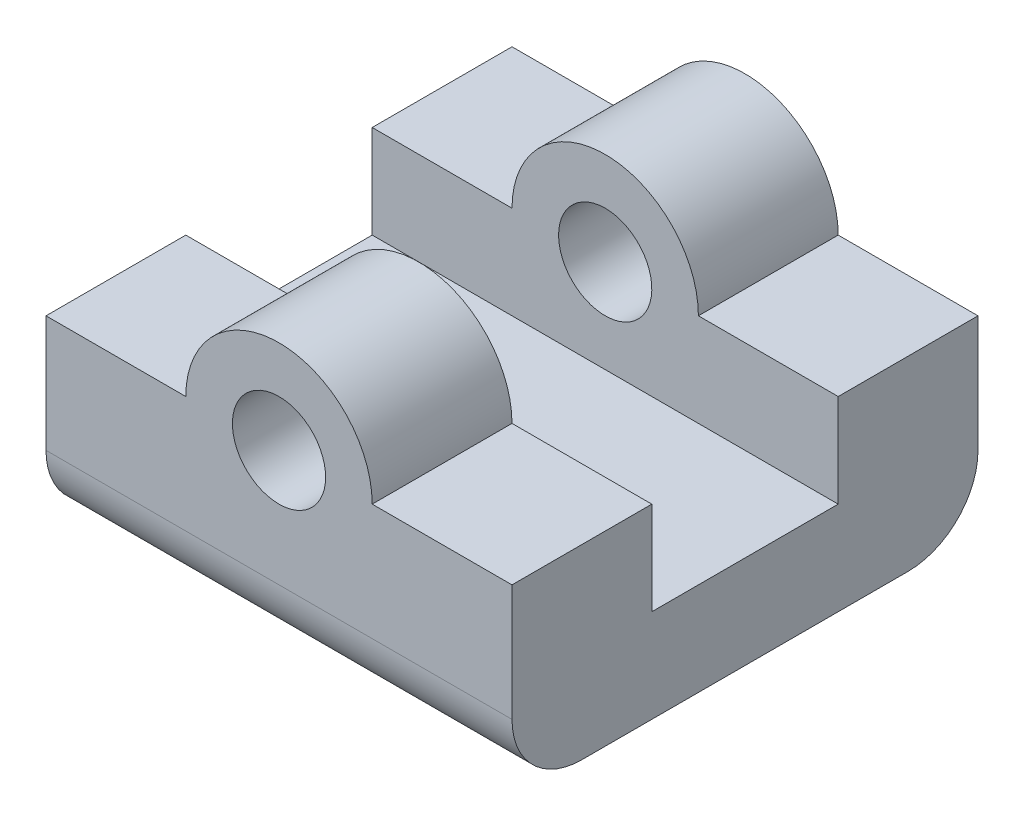
ISO-10303-21;
HEADER;
FILE_DESCRIPTION(('STEP AP214'),'2;1');
FILE_NAME('part.step','',(''),(''),'','','');
FILE_SCHEMA(('AUTOMOTIVE_DESIGN { 1 0 10303 214 1 1 1 1 }'));
ENDSEC;
DATA;
#1=APPLICATION_CONTEXT('core data for automotive mechanical design processes');
#2=APPLICATION_PROTOCOL_DEFINITION('international standard','automotive_design',2000,#1);
#3=PRODUCT_CONTEXT('',#1,'mechanical');
#4=PRODUCT('Part','Part','',(#3));
#5=PRODUCT_RELATED_PRODUCT_CATEGORY('part','',(#4));
#6=PRODUCT_DEFINITION_FORMATION('','',#4);
#7=PRODUCT_DEFINITION_CONTEXT('part definition',#1,'design');
#8=PRODUCT_DEFINITION('design','',#6,#7);
#9=PRODUCT_DEFINITION_SHAPE('','',#8);
#10=(LENGTH_UNIT() NAMED_UNIT(*) SI_UNIT(.MILLI.,.METRE.));
#11=(NAMED_UNIT(*) PLANE_ANGLE_UNIT() SI_UNIT($,.RADIAN.));
#12=(NAMED_UNIT(*) SI_UNIT($,.STERADIAN.) SOLID_ANGLE_UNIT());
#13=UNCERTAINTY_MEASURE_WITH_UNIT(LENGTH_MEASURE(1.E-05),#10,'distance_accuracy_value','');
#14=(GEOMETRIC_REPRESENTATION_CONTEXT(3) GLOBAL_UNCERTAINTY_ASSIGNED_CONTEXT((#13)) GLOBAL_UNIT_ASSIGNED_CONTEXT((#10,
#11,#12)) REPRESENTATION_CONTEXT('',''));
#15=CARTESIAN_POINT('',(0.,0.,0.));
#16=DIRECTION('',(0.,0.,1.));
#17=DIRECTION('',(1.,0.,0.));
#18=AXIS2_PLACEMENT_3D('',#15,#16,#17);
#19=CARTESIAN_POINT('',(-50.4804763273524,-10.,10.));
#20=DIRECTION('',(0.,-1.,0.));
#21=DIRECTION('',(0.,0.,-1.));
#22=AXIS2_PLACEMENT_3D('',#19,#20,#21);
#23=PLANE('',#22);
#24=DIRECTION('',(0.,0.,-1.));
#25=VECTOR('',#24,1.);
#26=CARTESIAN_POINT('',(-50.4804763273524,-10.,10.));
#27=LINE('',#26,#25);
#28=CARTESIAN_POINT('',(-50.4804763273524,-10.,10.));
#29=VERTEX_POINT('',#28);
#30=CARTESIAN_POINT('',(-50.4804763273524,-10.,4.));
#31=VERTEX_POINT('',#30);
#32=EDGE_CURVE('E228',#29,#31,#27,.T.);
#33=ORIENTED_EDGE('',*,*,#32,.T.);
#34=DIRECTION('',(-1.,0.,0.));
#35=VECTOR('',#34,1.);
#36=CARTESIAN_POINT('',(-50.4804763273524,-10.,4.));
#37=LINE('',#36,#35);
#38=CARTESIAN_POINT('',(-56.4804763273524,-10.,4.));
#39=VERTEX_POINT('',#38);
#40=EDGE_CURVE('E189',#31,#39,#37,.T.);
#41=ORIENTED_EDGE('',*,*,#40,.T.);
#42=DIRECTION('',(0.,0.,-1.));
#43=VECTOR('',#42,1.);
#44=CARTESIAN_POINT('',(-56.4804763273524,-10.,10.));
#45=LINE('',#44,#43);
#46=CARTESIAN_POINT('',(-56.4804763273524,-10.,10.));
#47=VERTEX_POINT('',#46);
#48=EDGE_CURVE('E244',#47,#39,#45,.T.);
#49=ORIENTED_EDGE('',*,*,#48,.F.);
#50=DIRECTION('',(-1.,0.,0.));
#51=VECTOR('',#50,1.);
#52=CARTESIAN_POINT('',(-50.4804763273524,-10.,10.));
#53=LINE('',#52,#51);
#54=EDGE_CURVE('E204',#29,#47,#53,.T.);
#55=ORIENTED_EDGE('',*,*,#54,.F.);
#56=EDGE_LOOP('',(#33,#41,#49,#55));
#57=FACE_BOUND('',#56,.T.);
#58=ADVANCED_FACE('F43',(#57),#23,.F.);
#59=CARTESIAN_POINT('',(-60.4804763273524,-10.,10.));
#60=DIRECTION('',(0.,0.,-1.));
#61=DIRECTION('',(-1.,0.,0.));
#62=AXIS2_PLACEMENT_3D('',#59,#60,#61);
#63=CYLINDRICAL_SURFACE('',#62,4.);
#64=ORIENTED_EDGE('',*,*,#48,.T.);
#65=CARTESIAN_POINT('',(-60.4804763273524,-10.,4.));
#66=DIRECTION('',(0.,0.,1.));
#67=DIRECTION('',(0.,-1.,0.));
#68=AXIS2_PLACEMENT_3D('',#65,#66,#67);
#69=CIRCLE('',#68,4.);
#70=CARTESIAN_POINT('',(-64.4804763273524,-10.,4.));
#71=VERTEX_POINT('',#70);
#72=EDGE_CURVE('E192',#39,#71,#69,.T.);
#73=ORIENTED_EDGE('',*,*,#72,.T.);
#74=DIRECTION('',(0.,0.,-1.));
#75=VECTOR('',#74,1.);
#76=CARTESIAN_POINT('',(-64.4804763273524,-10.,10.));
#77=LINE('',#76,#75);
#78=CARTESIAN_POINT('',(-64.4804763273524,-10.,10.));
#79=VERTEX_POINT('',#78);
#80=EDGE_CURVE('E240',#79,#71,#77,.T.);
#81=ORIENTED_EDGE('',*,*,#80,.F.);
#82=CARTESIAN_POINT('',(-60.4804763273524,-10.,10.));
#83=DIRECTION('',(0.,0.,1.));
#84=DIRECTION('',(1.,0.,0.));
#85=AXIS2_PLACEMENT_3D('',#82,#83,#84);
#86=CIRCLE('',#85,4.);
#87=EDGE_CURVE('E207',#47,#79,#86,.T.);
#88=ORIENTED_EDGE('',*,*,#87,.F.);
#89=EDGE_LOOP('',(#64,#73,#81,#88));
#90=FACE_BOUND('',#89,.T.);
#91=ADVANCED_FACE('F294',(#90),#63,.T.);
#92=CARTESIAN_POINT('',(-64.4804763273524,-10.,10.));
#93=DIRECTION('',(0.,-1.,0.));
#94=DIRECTION('',(0.,0.,-1.));
#95=AXIS2_PLACEMENT_3D('',#92,#93,#94);
#96=PLANE('',#95);
#97=ORIENTED_EDGE('',*,*,#80,.T.);
#98=DIRECTION('',(-1.,0.,0.));
#99=VECTOR('',#98,1.);
#100=CARTESIAN_POINT('',(-64.4804763273524,-10.,4.));
#101=LINE('',#100,#99);
#102=CARTESIAN_POINT('',(-70.4804763273524,-10.,4.));
#103=VERTEX_POINT('',#102);
#104=EDGE_CURVE('E195',#71,#103,#101,.T.);
#105=ORIENTED_EDGE('',*,*,#104,.T.);
#106=DIRECTION('',(0.,0.,-1.));
#107=VECTOR('',#106,1.);
#108=CARTESIAN_POINT('',(-70.4804763273524,-10.,10.));
#109=LINE('',#108,#107);
#110=CARTESIAN_POINT('',(-70.4804763273524,-10.,10.));
#111=VERTEX_POINT('',#110);
#112=EDGE_CURVE('E170',#111,#103,#109,.T.);
#113=ORIENTED_EDGE('',*,*,#112,.F.);
#114=DIRECTION('',(-1.,0.,0.));
#115=VECTOR('',#114,1.);
#116=CARTESIAN_POINT('',(-64.4804763273524,-10.,10.));
#117=LINE('',#116,#115);
#118=EDGE_CURVE('E210',#79,#111,#117,.T.);
#119=ORIENTED_EDGE('',*,*,#118,.F.);
#120=EDGE_LOOP('',(#97,#105,#113,#119));
#121=FACE_BOUND('',#120,.T.);
#122=ADVANCED_FACE('F300',(#121),#96,.F.);
#123=CARTESIAN_POINT('',(-60.4804763273524,-10.,10.));
#124=DIRECTION('',(0.,0.,-1.));
#125=DIRECTION('',(-1.,0.,0.));
#126=AXIS2_PLACEMENT_3D('',#123,#124,#125);
#127=CYLINDRICAL_SURFACE('',#126,2.);
#128=CARTESIAN_POINT('',(-60.4804763273524,-10.,4.));
#129=DIRECTION('',(0.,0.,1.));
#130=DIRECTION('',(0.,-1.,0.));
#131=AXIS2_PLACEMENT_3D('',#128,#129,#130);
#132=CIRCLE('',#131,2.);
#133=CARTESIAN_POINT('',(-60.4804763273524,-12.,4.));
#134=VERTEX_POINT('',#133);
#135=EDGE_CURVE('E187',#134,#134,#132,.T.);
#136=ORIENTED_EDGE('',*,*,#135,.F.);
#137=EDGE_LOOP('',(#136));
#138=FACE_BOUND('',#137,.T.);
#139=CARTESIAN_POINT('',(-60.4804763273524,-10.,10.));
#140=DIRECTION('',(0.,0.,1.));
#141=DIRECTION('',(1.,0.,0.));
#142=AXIS2_PLACEMENT_3D('',#139,#140,#141);
#143=CIRCLE('',#142,2.);
#144=CARTESIAN_POINT('',(-58.4804763273524,-10.,10.));
#145=VERTEX_POINT('',#144);
#146=EDGE_CURVE('E198',#145,#145,#143,.T.);
#147=ORIENTED_EDGE('',*,*,#146,.T.);
#148=EDGE_LOOP('',(#147));
#149=FACE_BOUND('',#148,.T.);
#150=ADVANCED_FACE('F332',(#138,#149),#127,.F.);
#151=CARTESIAN_POINT('',(-60.4804763273524,-10.,10.));
#152=DIRECTION('',(0.,0.,1.));
#153=DIRECTION('',(1.,0.,0.));
#154=AXIS2_PLACEMENT_3D('',#151,#152,#153);
#155=PLANE('',#154);
#156=DIRECTION('',(0.,-1.,0.));
#157=VECTOR('',#156,1.);
#158=CARTESIAN_POINT('',(-70.4804763273524,-10.,10.));
#159=LINE('',#158,#157);
#160=CARTESIAN_POINT('',(-70.4804763273524,-15.,10.));
#161=VERTEX_POINT('',#160);
#162=EDGE_CURVE('E212',#111,#161,#159,.T.);
#163=ORIENTED_EDGE('',*,*,#162,.T.);
#164=DIRECTION('',(1.,0.,0.));
#165=VECTOR('',#164,1.);
#166=CARTESIAN_POINT('',(-50.4804763273524,-15.,10.));
#167=LINE('',#166,#165);
#168=CARTESIAN_POINT('',(-50.4804763273524,-15.,10.));
#169=VERTEX_POINT('',#168);
#170=EDGE_CURVE('E11',#161,#169,#167,.T.);
#171=ORIENTED_EDGE('',*,*,#170,.T.);
#172=DIRECTION('',(0.,1.,0.));
#173=VECTOR('',#172,1.);
#174=CARTESIAN_POINT('',(-50.4804763273524,-18.,10.));
#175=LINE('',#174,#173);
#176=EDGE_CURVE('E214',#169,#29,#175,.T.);
#177=ORIENTED_EDGE('',*,*,#176,.T.);
#178=ORIENTED_EDGE('',*,*,#54,.T.);
#179=ORIENTED_EDGE('',*,*,#87,.T.);
#180=ORIENTED_EDGE('',*,*,#118,.T.);
#181=EDGE_LOOP('',(#163,#171,#177,#178,#179,#180));
#182=FACE_BOUND('',#181,.T.);
#183=ORIENTED_EDGE('',*,*,#146,.F.);
#184=EDGE_LOOP('',(#183));
#185=FACE_BOUND('',#184,.T.);
#186=ADVANCED_FACE('F333',(#182,#185),#155,.T.);
#187=CARTESIAN_POINT('',(-60.4804763273524,-10.,-10.));
#188=DIRECTION('',(0.,0.,1.));
#189=DIRECTION('',(1.,0.,0.));
#190=AXIS2_PLACEMENT_3D('',#187,#188,#189);
#191=PLANE('',#190);
#192=DIRECTION('',(0.,1.,0.));
#193=VECTOR('',#192,1.);
#194=CARTESIAN_POINT('',(-50.4804763273524,-18.,-10.));
#195=LINE('',#194,#193);
#196=CARTESIAN_POINT('',(-50.4804763273524,-15.,-10.));
#197=VERTEX_POINT('',#196);
#198=CARTESIAN_POINT('',(-50.4804763273524,-10.,-10.));
#199=VERTEX_POINT('',#198);
#200=EDGE_CURVE('E208',#197,#199,#195,.T.);
#201=ORIENTED_EDGE('',*,*,#200,.F.);
#202=DIRECTION('',(1.,0.,0.));
#203=VECTOR('',#202,1.);
#204=CARTESIAN_POINT('',(-60.4804763273524,-15.,-10.));
#205=LINE('',#204,#203);
#206=CARTESIAN_POINT('',(-70.4804763273524,-15.,-10.));
#207=VERTEX_POINT('',#206);
#208=EDGE_CURVE('E66',#197,#207,#205,.F.);
#209=ORIENTED_EDGE('',*,*,#208,.T.);
#210=DIRECTION('',(0.,-1.,0.));
#211=VECTOR('',#210,1.);
#212=CARTESIAN_POINT('',(-70.4804763273524,-10.,-10.));
#213=LINE('',#212,#211);
#214=CARTESIAN_POINT('',(-70.4804763273524,-10.,-10.));
#215=VERTEX_POINT('',#214);
#216=EDGE_CURVE('E225',#215,#207,#213,.T.);
#217=ORIENTED_EDGE('',*,*,#216,.F.);
#218=DIRECTION('',(-1.,0.,0.));
#219=VECTOR('',#218,1.);
#220=CARTESIAN_POINT('',(-64.4804763273524,-10.,-10.));
#221=LINE('',#220,#219);
#222=CARTESIAN_POINT('',(-64.4804763273524,-10.,-10.));
#223=VERTEX_POINT('',#222);
#224=EDGE_CURVE('E222',#223,#215,#221,.T.);
#225=ORIENTED_EDGE('',*,*,#224,.F.);
#226=CARTESIAN_POINT('',(-60.4804763273524,-10.,-10.));
#227=DIRECTION('',(0.,0.,1.));
#228=DIRECTION('',(1.,0.,0.));
#229=AXIS2_PLACEMENT_3D('',#226,#227,#228);
#230=CIRCLE('',#229,4.);
#231=CARTESIAN_POINT('',(-56.4804763273524,-10.,-10.));
#232=VERTEX_POINT('',#231);
#233=EDGE_CURVE('E219',#232,#223,#230,.T.);
#234=ORIENTED_EDGE('',*,*,#233,.F.);
#235=DIRECTION('',(-1.,0.,0.));
#236=VECTOR('',#235,1.);
#237=CARTESIAN_POINT('',(-50.4804763273524,-10.,-10.));
#238=LINE('',#237,#236);
#239=EDGE_CURVE('E201',#199,#232,#238,.T.);
#240=ORIENTED_EDGE('',*,*,#239,.F.);
#241=EDGE_LOOP('',(#201,#209,#217,#225,#234,#240));
#242=FACE_BOUND('',#241,.T.);
#243=CARTESIAN_POINT('',(-60.4804763273524,-10.,-10.));
#244=DIRECTION('',(0.,0.,1.));
#245=DIRECTION('',(1.,0.,0.));
#246=AXIS2_PLACEMENT_3D('',#243,#244,#245);
#247=CIRCLE('',#246,2.);
#248=CARTESIAN_POINT('',(-58.4804763273524,-10.,-10.));
#249=VERTEX_POINT('',#248);
#250=EDGE_CURVE('E197',#249,#249,#247,.T.);
#251=ORIENTED_EDGE('',*,*,#250,.T.);
#252=EDGE_LOOP('',(#251));
#253=FACE_BOUND('',#252,.T.);
#254=ADVANCED_FACE('F276',(#242,#253),#191,.F.);
#255=CARTESIAN_POINT('',(-56.4804763273524,-10.,-4.));
#256=VERTEX_POINT('',#255);
#257=EDGE_CURVE('E243',#256,#232,#45,.T.);
#258=ORIENTED_EDGE('',*,*,#257,.F.);
#259=DIRECTION('',(1.,0.,0.));
#260=VECTOR('',#259,1.);
#261=CARTESIAN_POINT('',(-50.4804763273524,-10.,-4.));
#262=LINE('',#261,#260);
#263=CARTESIAN_POINT('',(-50.4804763273524,-10.,-4.));
#264=VERTEX_POINT('',#263);
#265=EDGE_CURVE('E179',#256,#264,#262,.T.);
#266=ORIENTED_EDGE('',*,*,#265,.T.);
#267=EDGE_CURVE('E216',#264,#199,#27,.T.);
#268=ORIENTED_EDGE('',*,*,#267,.T.);
#269=ORIENTED_EDGE('',*,*,#239,.T.);
#270=EDGE_LOOP('',(#258,#266,#268,#269));
#271=FACE_BOUND('',#270,.T.);
#272=ADVANCED_FACE('F282',(#271),#23,.F.);
#273=CARTESIAN_POINT('',(-60.4804763273524,-10.,-4.));
#274=DIRECTION('',(0.,0.,-1.));
#275=DIRECTION('',(0.,1.,0.));
#276=AXIS2_PLACEMENT_3D('',#273,#274,#275);
#277=CIRCLE('',#276,4.);
#278=CARTESIAN_POINT('',(-64.4804763273524,-10.,-4.));
#279=VERTEX_POINT('',#278);
#280=EDGE_CURVE('E182',#279,#256,#277,.T.);
#281=ORIENTED_EDGE('',*,*,#280,.T.);
#282=ORIENTED_EDGE('',*,*,#257,.T.);
#283=ORIENTED_EDGE('',*,*,#233,.T.);
#284=EDGE_CURVE('E239',#279,#223,#77,.T.);
#285=ORIENTED_EDGE('',*,*,#284,.F.);
#286=EDGE_LOOP('',(#281,#282,#283,#285));
#287=FACE_BOUND('',#286,.T.);
#288=ADVANCED_FACE('F291',(#287),#63,.T.);
#289=CARTESIAN_POINT('',(-70.4804763273524,-10.,-4.));
#290=VERTEX_POINT('',#289);
#291=EDGE_CURVE('E237',#290,#215,#109,.T.);
#292=ORIENTED_EDGE('',*,*,#291,.F.);
#293=DIRECTION('',(1.,0.,0.));
#294=VECTOR('',#293,1.);
#295=CARTESIAN_POINT('',(-64.4804763273524,-10.,-4.));
#296=LINE('',#295,#294);
#297=EDGE_CURVE('E184',#290,#279,#296,.T.);
#298=ORIENTED_EDGE('',*,*,#297,.T.);
#299=ORIENTED_EDGE('',*,*,#284,.T.);
#300=ORIENTED_EDGE('',*,*,#224,.T.);
#301=EDGE_LOOP('',(#292,#298,#299,#300));
#302=FACE_BOUND('',#301,.T.);
#303=ADVANCED_FACE('F288',(#302),#96,.F.);
#304=CARTESIAN_POINT('',(-70.4804763273524,-10.,10.));
#305=DIRECTION('',(1.,0.,0.));
#306=DIRECTION('',(0.,0.,-1.));
#307=AXIS2_PLACEMENT_3D('',#304,#305,#306);
#308=PLANE('',#307);
#309=ORIENTED_EDGE('',*,*,#216,.T.);
#310=CARTESIAN_POINT('',(-70.4804763273524,-15.,-7.));
#311=DIRECTION('',(1.,0.,0.));
#312=DIRECTION('',(0.,0.,-1.));
#313=AXIS2_PLACEMENT_3D('',#310,#311,#312);
#314=CIRCLE('',#313,3.);
#315=CARTESIAN_POINT('',(-70.4804763273524,-18.,-7.));
#316=VERTEX_POINT('',#315);
#317=EDGE_CURVE('E51',#207,#316,#314,.F.);
#318=ORIENTED_EDGE('',*,*,#317,.T.);
#319=DIRECTION('',(0.,0.,-1.));
#320=VECTOR('',#319,1.);
#321=CARTESIAN_POINT('',(-70.4804763273524,-18.,10.));
#322=LINE('',#321,#320);
#323=CARTESIAN_POINT('',(-70.4804763273524,-18.,7.));
#324=VERTEX_POINT('',#323);
#325=EDGE_CURVE('E234',#324,#316,#322,.T.);
#326=ORIENTED_EDGE('',*,*,#325,.F.);
#327=CARTESIAN_POINT('',(-70.4804763273524,-15.,7.));
#328=DIRECTION('',(1.,0.,0.));
#329=DIRECTION('',(0.,0.,-1.));
#330=AXIS2_PLACEMENT_3D('',#327,#328,#329);
#331=CIRCLE('',#330,3.);
#332=EDGE_CURVE('E58',#324,#161,#331,.F.);
#333=ORIENTED_EDGE('',*,*,#332,.T.);
#334=ORIENTED_EDGE('',*,*,#162,.F.);
#335=ORIENTED_EDGE('',*,*,#112,.T.);
#336=DIRECTION('',(0.,-1.,0.));
#337=VECTOR('',#336,1.);
#338=CARTESIAN_POINT('',(-70.4804763273524,-6.00000000000001,4.));
#339=LINE('',#338,#337);
#340=CARTESIAN_POINT('',(-70.4804763273524,-14.,4.));
#341=VERTEX_POINT('',#340);
#342=EDGE_CURVE('E151',#103,#341,#339,.T.);
#343=ORIENTED_EDGE('',*,*,#342,.T.);
#344=DIRECTION('',(0.,0.,-1.));
#345=VECTOR('',#344,1.);
#346=CARTESIAN_POINT('',(-70.4804763273524,-14.,4.));
#347=LINE('',#346,#345);
#348=CARTESIAN_POINT('',(-70.4804763273524,-14.,-4.));
#349=VERTEX_POINT('',#348);
#350=EDGE_CURVE('E161',#341,#349,#347,.T.);
#351=ORIENTED_EDGE('',*,*,#350,.T.);
#352=DIRECTION('',(0.,1.,0.));
#353=VECTOR('',#352,1.);
#354=CARTESIAN_POINT('',(-70.4804763273524,-6.00000000000001,-4.));
#355=LINE('',#354,#353);
#356=EDGE_CURVE('E158',#349,#290,#355,.T.);
#357=ORIENTED_EDGE('',*,*,#356,.T.);
#358=ORIENTED_EDGE('',*,*,#291,.T.);
#359=EDGE_LOOP('',(#309,#318,#326,#333,#334,#335,#343,#351,#357,#358));
#360=FACE_BOUND('',#359,.T.);
#361=ADVANCED_FACE('F168',(#360),#308,.F.);
#362=CARTESIAN_POINT('',(-70.4804763273524,-18.,10.));
#363=DIRECTION('',(0.,1.,0.));
#364=DIRECTION('',(0.,0.,1.));
#365=AXIS2_PLACEMENT_3D('',#362,#363,#364);
#366=PLANE('',#365);
#367=ORIENTED_EDGE('',*,*,#325,.T.);
#368=DIRECTION('',(1.,0.,0.));
#369=VECTOR('',#368,1.);
#370=CARTESIAN_POINT('',(-70.4804763273524,-18.,-7.));
#371=LINE('',#370,#369);
#372=CARTESIAN_POINT('',(-50.4804763273524,-18.,-7.));
#373=VERTEX_POINT('',#372);
#374=EDGE_CURVE('E255',#316,#373,#371,.T.);
#375=ORIENTED_EDGE('',*,*,#374,.T.);
#376=DIRECTION('',(0.,0.,-1.));
#377=VECTOR('',#376,1.);
#378=CARTESIAN_POINT('',(-50.4804763273524,-18.,10.));
#379=LINE('',#378,#377);
#380=CARTESIAN_POINT('',(-50.4804763273524,-18.,7.));
#381=VERTEX_POINT('',#380);
#382=EDGE_CURVE('E231',#381,#373,#379,.T.);
#383=ORIENTED_EDGE('',*,*,#382,.F.);
#384=DIRECTION('',(1.,0.,0.));
#385=VECTOR('',#384,1.);
#386=CARTESIAN_POINT('',(-70.4804763273524,-18.,7.));
#387=LINE('',#386,#385);
#388=EDGE_CURVE('E253',#381,#324,#387,.F.);
#389=ORIENTED_EDGE('',*,*,#388,.T.);
#390=EDGE_LOOP('',(#367,#375,#383,#389));
#391=FACE_BOUND('',#390,.T.);
#392=ADVANCED_FACE('F267',(#391),#366,.F.);
#393=CARTESIAN_POINT('',(-50.4804763273524,-18.,10.));
#394=DIRECTION('',(-1.,0.,0.));
#395=DIRECTION('',(0.,0.,1.));
#396=AXIS2_PLACEMENT_3D('',#393,#394,#395);
#397=PLANE('',#396);
#398=ORIENTED_EDGE('',*,*,#382,.T.);
#399=CARTESIAN_POINT('',(-50.4804763273524,-15.,-7.));
#400=DIRECTION('',(-1.,0.,0.));
#401=DIRECTION('',(0.,0.,1.));
#402=AXIS2_PLACEMENT_3D('',#399,#400,#401);
#403=CIRCLE('',#402,3.);
#404=EDGE_CURVE('E260',#373,#197,#403,.F.);
#405=ORIENTED_EDGE('',*,*,#404,.T.);
#406=ORIENTED_EDGE('',*,*,#200,.T.);
#407=ORIENTED_EDGE('',*,*,#267,.F.);
#408=DIRECTION('',(0.,-1.,0.));
#409=VECTOR('',#408,1.);
#410=CARTESIAN_POINT('',(-50.4804763273524,-18.,-4.));
#411=LINE('',#410,#409);
#412=CARTESIAN_POINT('',(-50.4804763273524,-14.,-4.));
#413=VERTEX_POINT('',#412);
#414=EDGE_CURVE('E176',#264,#413,#411,.T.);
#415=ORIENTED_EDGE('',*,*,#414,.T.);
#416=DIRECTION('',(0.,0.,1.));
#417=VECTOR('',#416,1.);
#418=CARTESIAN_POINT('',(-50.4804763273524,-14.,10.));
#419=LINE('',#418,#417);
#420=CARTESIAN_POINT('',(-50.4804763273524,-14.,4.));
#421=VERTEX_POINT('',#420);
#422=EDGE_CURVE('E247',#413,#421,#419,.T.);
#423=ORIENTED_EDGE('',*,*,#422,.T.);
#424=DIRECTION('',(0.,1.,0.));
#425=VECTOR('',#424,1.);
#426=CARTESIAN_POINT('',(-50.4804763273524,-18.,4.));
#427=LINE('',#426,#425);
#428=EDGE_CURVE('E154',#421,#31,#427,.T.);
#429=ORIENTED_EDGE('',*,*,#428,.T.);
#430=ORIENTED_EDGE('',*,*,#32,.F.);
#431=ORIENTED_EDGE('',*,*,#176,.F.);
#432=CARTESIAN_POINT('',(-50.4804763273524,-15.,7.));
#433=DIRECTION('',(-1.,0.,0.));
#434=DIRECTION('',(0.,0.,1.));
#435=AXIS2_PLACEMENT_3D('',#432,#433,#434);
#436=CIRCLE('',#435,3.);
#437=EDGE_CURVE('E258',#169,#381,#436,.F.);
#438=ORIENTED_EDGE('',*,*,#437,.T.);
#439=EDGE_LOOP('',(#398,#405,#406,#407,#415,#423,#429,#430,#431,#438));
#440=FACE_BOUND('',#439,.T.);
#441=ADVANCED_FACE('F272',(#440),#397,.F.);
#442=CARTESIAN_POINT('',(-60.4804763273524,-10.,-4.));
#443=DIRECTION('',(0.,0.,-1.));
#444=DIRECTION('',(0.,1.,0.));
#445=AXIS2_PLACEMENT_3D('',#442,#443,#444);
#446=CIRCLE('',#445,2.);
#447=CARTESIAN_POINT('',(-60.4804763273524,-8.,-4.));
#448=VERTEX_POINT('',#447);
#449=EDGE_CURVE('E174',#448,#448,#446,.T.);
#450=ORIENTED_EDGE('',*,*,#449,.F.);
#451=EDGE_LOOP('',(#450));
#452=FACE_BOUND('',#451,.T.);
#453=ORIENTED_EDGE('',*,*,#250,.F.);
#454=EDGE_LOOP('',(#453));
#455=FACE_BOUND('',#454,.T.);
#456=ADVANCED_FACE('F327',(#452,#455),#127,.F.);
#457=CARTESIAN_POINT('',(-70.4804763273524,-14.,4.));
#458=DIRECTION('',(0.,-1.,0.));
#459=DIRECTION('',(0.,0.,-1.));
#460=AXIS2_PLACEMENT_3D('',#457,#458,#459);
#461=PLANE('',#460);
#462=DIRECTION('',(1.,0.,0.));
#463=VECTOR('',#462,1.);
#464=CARTESIAN_POINT('',(-70.4804763273524,-14.,-4.));
#465=LINE('',#464,#463);
#466=EDGE_CURVE('E157',#349,#413,#465,.T.);
#467=ORIENTED_EDGE('',*,*,#466,.F.);
#468=ORIENTED_EDGE('',*,*,#350,.F.);
#469=DIRECTION('',(1.,0.,0.));
#470=VECTOR('',#469,1.);
#471=CARTESIAN_POINT('',(-70.4804763273524,-14.,4.));
#472=LINE('',#471,#470);
#473=EDGE_CURVE('E147',#341,#421,#472,.T.);
#474=ORIENTED_EDGE('',*,*,#473,.T.);
#475=ORIENTED_EDGE('',*,*,#422,.F.);
#476=EDGE_LOOP('',(#467,#468,#474,#475));
#477=FACE_BOUND('',#476,.T.);
#478=ADVANCED_FACE('F162',(#477),#461,.F.);
#479=CARTESIAN_POINT('',(-70.4804763273524,-6.00000000000001,4.));
#480=DIRECTION('',(0.,0.,1.));
#481=DIRECTION('',(0.,-1.,0.));
#482=AXIS2_PLACEMENT_3D('',#479,#480,#481);
#483=PLANE('',#482);
#484=ORIENTED_EDGE('',*,*,#135,.T.);
#485=EDGE_LOOP('',(#484));
#486=FACE_BOUND('',#485,.T.);
#487=ORIENTED_EDGE('',*,*,#72,.F.);
#488=ORIENTED_EDGE('',*,*,#40,.F.);
#489=ORIENTED_EDGE('',*,*,#428,.F.);
#490=ORIENTED_EDGE('',*,*,#473,.F.);
#491=ORIENTED_EDGE('',*,*,#342,.F.);
#492=ORIENTED_EDGE('',*,*,#104,.F.);
#493=EDGE_LOOP('',(#487,#488,#489,#490,#491,#492));
#494=FACE_BOUND('',#493,.T.);
#495=ADVANCED_FACE('F149',(#486,#494),#483,.F.);
#496=CARTESIAN_POINT('',(-70.4804763273524,-6.00000000000001,-4.));
#497=DIRECTION('',(0.,0.,-1.));
#498=DIRECTION('',(0.,1.,0.));
#499=AXIS2_PLACEMENT_3D('',#496,#497,#498);
#500=PLANE('',#499);
#501=ORIENTED_EDGE('',*,*,#449,.T.);
#502=EDGE_LOOP('',(#501));
#503=FACE_BOUND('',#502,.T.);
#504=ORIENTED_EDGE('',*,*,#356,.F.);
#505=ORIENTED_EDGE('',*,*,#466,.T.);
#506=ORIENTED_EDGE('',*,*,#414,.F.);
#507=ORIENTED_EDGE('',*,*,#265,.F.);
#508=ORIENTED_EDGE('',*,*,#280,.F.);
#509=ORIENTED_EDGE('',*,*,#297,.F.);
#510=EDGE_LOOP('',(#504,#505,#506,#507,#508,#509));
#511=FACE_BOUND('',#510,.T.);
#512=ADVANCED_FACE('F285',(#503,#511),#500,.F.);
#513=CARTESIAN_POINT('',(-70.4804763273524,-15.,-7.));
#514=DIRECTION('',(1.,0.,0.));
#515=DIRECTION('',(0.,0.,-1.));
#516=AXIS2_PLACEMENT_3D('',#513,#514,#515);
#517=CYLINDRICAL_SURFACE('',#516,3.);
#518=ORIENTED_EDGE('',*,*,#317,.F.);
#519=ORIENTED_EDGE('',*,*,#208,.F.);
#520=ORIENTED_EDGE('',*,*,#404,.F.);
#521=ORIENTED_EDGE('',*,*,#374,.F.);
#522=EDGE_LOOP('',(#518,#519,#520,#521));
#523=FACE_BOUND('',#522,.T.);
#524=ADVANCED_FACE('F270',(#523),#517,.T.);
#525=CARTESIAN_POINT('',(-60.4804763273524,-15.,7.));
#526=DIRECTION('',(-1.,0.,0.));
#527=DIRECTION('',(0.,0.,1.));
#528=AXIS2_PLACEMENT_3D('',#525,#526,#527);
#529=CYLINDRICAL_SURFACE('',#528,3.);
#530=ORIENTED_EDGE('',*,*,#332,.F.);
#531=ORIENTED_EDGE('',*,*,#388,.F.);
#532=ORIENTED_EDGE('',*,*,#437,.F.);
#533=ORIENTED_EDGE('',*,*,#170,.F.);
#534=EDGE_LOOP('',(#530,#531,#532,#533));
#535=FACE_BOUND('',#534,.T.);
#536=ADVANCED_FACE('F45',(#535),#529,.T.);
#537=CLOSED_SHELL('',(#58,#91,#122,#150,#186,#254,#272,#288,#303,#361,#392,#441,#456,#478,#495,
#512,#524,#536));
#538=MANIFOLD_SOLID_BREP('B2',#537);
#539=ADVANCED_BREP_SHAPE_REPRESENTATION('',(#18,#538),#14);
#540=SHAPE_DEFINITION_REPRESENTATION(#9,#539);
ENDSEC;
END-ISO-10303-21;
